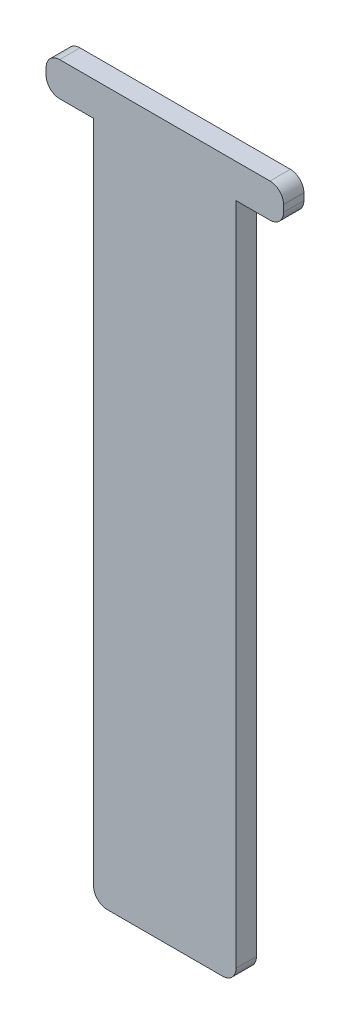
ISO-10303-21;
HEADER;
FILE_DESCRIPTION(('STEP AP214'),'2;1');
FILE_NAME('part.step','',(''),(''),'','','');
FILE_SCHEMA(('AUTOMOTIVE_DESIGN { 1 0 10303 214 1 1 1 1 }'));
ENDSEC;
DATA;
#1=APPLICATION_CONTEXT('core data for automotive mechanical design processes');
#2=APPLICATION_PROTOCOL_DEFINITION('international standard','automotive_design',2000,#1);
#3=PRODUCT_CONTEXT('',#1,'mechanical');
#4=PRODUCT('Part','Part','',(#3));
#5=PRODUCT_RELATED_PRODUCT_CATEGORY('part','',(#4));
#6=PRODUCT_DEFINITION_FORMATION('','',#4);
#7=PRODUCT_DEFINITION_CONTEXT('part definition',#1,'design');
#8=PRODUCT_DEFINITION('design','',#6,#7);
#9=PRODUCT_DEFINITION_SHAPE('','',#8);
#10=(LENGTH_UNIT() NAMED_UNIT(*) SI_UNIT(.MILLI.,.METRE.));
#11=(NAMED_UNIT(*) PLANE_ANGLE_UNIT() SI_UNIT($,.RADIAN.));
#12=(NAMED_UNIT(*) SI_UNIT($,.STERADIAN.) SOLID_ANGLE_UNIT());
#13=UNCERTAINTY_MEASURE_WITH_UNIT(LENGTH_MEASURE(1.E-05),#10,'distance_accuracy_value','');
#14=(GEOMETRIC_REPRESENTATION_CONTEXT(3) GLOBAL_UNCERTAINTY_ASSIGNED_CONTEXT((#13)) GLOBAL_UNIT_ASSIGNED_CONTEXT((#10,
#11,#12)) REPRESENTATION_CONTEXT('',''));
#15=CARTESIAN_POINT('',(0.,0.,0.));
#16=DIRECTION('',(0.,0.,1.));
#17=DIRECTION('',(1.,0.,0.));
#18=AXIS2_PLACEMENT_3D('',#15,#16,#17);
#19=CARTESIAN_POINT('',(-11.7609707284145,86.0573770491803,3.));
#20=DIRECTION('',(0.,1.,0.));
#21=DIRECTION('',(0.,0.,1.));
#22=AXIS2_PLACEMENT_3D('',#19,#20,#21);
#23=PLANE('',#22);
#24=DIRECTION('',(1.,0.,0.));
#25=VECTOR('',#24,1.);
#26=CARTESIAN_POINT('',(-11.7609707284145,86.0573770491803,0.));
#27=LINE('',#26,#25);
#28=CARTESIAN_POINT('',(-16.7609707284145,86.0573770491803,0.));
#29=VERTEX_POINT('',#28);
#30=CARTESIAN_POINT('',(-11.7609707284145,86.0573770491803,0.));
#31=VERTEX_POINT('',#30);
#32=EDGE_CURVE('E165',#29,#31,#27,.T.);
#33=ORIENTED_EDGE('',*,*,#32,.T.);
#34=DIRECTION('',(0.,0.,-1.));
#35=VECTOR('',#34,1.);
#36=CARTESIAN_POINT('',(-11.7609707284145,86.0573770491803,3.));
#37=LINE('',#36,#35);
#38=CARTESIAN_POINT('',(-11.7609707284145,86.0573770491803,3.));
#39=VERTEX_POINT('',#38);
#40=EDGE_CURVE('E11',#39,#31,#37,.T.);
#41=ORIENTED_EDGE('',*,*,#40,.F.);
#42=DIRECTION('',(1.,0.,0.));
#43=VECTOR('',#42,1.);
#44=CARTESIAN_POINT('',(-11.7609707284145,86.0573770491803,3.));
#45=LINE('',#44,#43);
#46=CARTESIAN_POINT('',(-16.7609707284145,86.0573770491803,3.));
#47=VERTEX_POINT('',#46);
#48=EDGE_CURVE('E191',#47,#39,#45,.T.);
#49=ORIENTED_EDGE('',*,*,#48,.F.);
#50=DIRECTION('',(0.,0.,-1.));
#51=VECTOR('',#50,1.);
#52=CARTESIAN_POINT('',(-16.7609707284145,86.0573770491803,3.));
#53=LINE('',#52,#51);
#54=EDGE_CURVE('E161',#47,#29,#53,.T.);
#55=ORIENTED_EDGE('',*,*,#54,.T.);
#56=EDGE_LOOP('',(#33,#41,#49,#55));
#57=FACE_BOUND('',#56,.T.);
#58=ADVANCED_FACE('F33',(#57),#23,.F.);
#59=CARTESIAN_POINT('',(-11.7609707284145,-11.9426229508197,3.));
#60=DIRECTION('',(1.,0.,0.));
#61=DIRECTION('',(0.,0.,-1.));
#62=AXIS2_PLACEMENT_3D('',#59,#60,#61);
#63=PLANE('',#62);
#64=DIRECTION('',(0.,-1.,0.));
#65=VECTOR('',#64,1.);
#66=CARTESIAN_POINT('',(-11.7609707284145,-11.9426229508197,0.));
#67=LINE('',#66,#65);
#68=CARTESIAN_POINT('',(-11.7609707284145,-11.9426229508197,0.));
#69=VERTEX_POINT('',#68);
#70=EDGE_CURVE('E168',#31,#69,#67,.T.);
#71=ORIENTED_EDGE('',*,*,#70,.T.);
#72=DIRECTION('',(0.,0.,-1.));
#73=VECTOR('',#72,1.);
#74=CARTESIAN_POINT('',(-11.7609707284145,-11.9426229508197,3.));
#75=LINE('',#74,#73);
#76=CARTESIAN_POINT('',(-11.7609707284145,-11.9426229508197,3.));
#77=VERTEX_POINT('',#76);
#78=EDGE_CURVE('E41',#77,#69,#75,.T.);
#79=ORIENTED_EDGE('',*,*,#78,.F.);
#80=DIRECTION('',(0.,-1.,0.));
#81=VECTOR('',#80,1.);
#82=CARTESIAN_POINT('',(-11.7609707284145,-11.9426229508197,3.));
#83=LINE('',#82,#81);
#84=EDGE_CURVE('E110',#39,#77,#83,.T.);
#85=ORIENTED_EDGE('',*,*,#84,.F.);
#86=ORIENTED_EDGE('',*,*,#40,.T.);
#87=EDGE_LOOP('',(#71,#79,#85,#86));
#88=FACE_BOUND('',#87,.T.);
#89=ADVANCED_FACE('F279',(#88),#63,.F.);
#90=CARTESIAN_POINT('',(-9.76097072841453,-11.9426229508197,3.));
#91=DIRECTION('',(0.,0.,-1.));
#92=DIRECTION('',(-1.,0.,0.));
#93=AXIS2_PLACEMENT_3D('',#90,#91,#92);
#94=CYLINDRICAL_SURFACE('',#93,2.);
#95=CARTESIAN_POINT('',(-9.76097072841453,-11.9426229508197,0.));
#96=DIRECTION('',(0.,0.,1.));
#97=DIRECTION('',(-1.,0.,0.));
#98=AXIS2_PLACEMENT_3D('',#95,#96,#97);
#99=CIRCLE('',#98,2.);
#100=CARTESIAN_POINT('',(-9.76097072841453,-13.9426229508197,0.));
#101=VERTEX_POINT('',#100);
#102=EDGE_CURVE('E170',#69,#101,#99,.T.);
#103=ORIENTED_EDGE('',*,*,#102,.T.);
#104=DIRECTION('',(0.,0.,-1.));
#105=VECTOR('',#104,1.);
#106=CARTESIAN_POINT('',(-9.76097072841453,-13.9426229508197,3.));
#107=LINE('',#106,#105);
#108=CARTESIAN_POINT('',(-9.76097072841453,-13.9426229508197,3.));
#109=VERTEX_POINT('',#108);
#110=EDGE_CURVE('E216',#109,#101,#107,.T.);
#111=ORIENTED_EDGE('',*,*,#110,.F.);
#112=CARTESIAN_POINT('',(-9.76097072841453,-11.9426229508197,3.));
#113=DIRECTION('',(0.,0.,1.));
#114=DIRECTION('',(-1.,0.,0.));
#115=AXIS2_PLACEMENT_3D('',#112,#113,#114);
#116=CIRCLE('',#115,2.);
#117=EDGE_CURVE('E224',#77,#109,#116,.T.);
#118=ORIENTED_EDGE('',*,*,#117,.F.);
#119=ORIENTED_EDGE('',*,*,#78,.T.);
#120=EDGE_LOOP('',(#103,#111,#118,#119));
#121=FACE_BOUND('',#120,.T.);
#122=ADVANCED_FACE('F222',(#121),#94,.T.);
#123=CARTESIAN_POINT('',(7.23902927158547,-13.9426229508197,3.));
#124=DIRECTION('',(0.,1.,0.));
#125=DIRECTION('',(0.,0.,1.));
#126=AXIS2_PLACEMENT_3D('',#123,#124,#125);
#127=PLANE('',#126);
#128=DIRECTION('',(1.,0.,0.));
#129=VECTOR('',#128,1.);
#130=CARTESIAN_POINT('',(7.23902927158547,-13.9426229508197,0.));
#131=LINE('',#130,#129);
#132=CARTESIAN_POINT('',(7.23902927158547,-13.9426229508197,0.));
#133=VERTEX_POINT('',#132);
#134=EDGE_CURVE('E172',#101,#133,#131,.T.);
#135=ORIENTED_EDGE('',*,*,#134,.T.);
#136=DIRECTION('',(0.,0.,-1.));
#137=VECTOR('',#136,1.);
#138=CARTESIAN_POINT('',(7.23902927158547,-13.9426229508197,3.));
#139=LINE('',#138,#137);
#140=CARTESIAN_POINT('',(7.23902927158547,-13.9426229508197,3.));
#141=VERTEX_POINT('',#140);
#142=EDGE_CURVE('E213',#141,#133,#139,.T.);
#143=ORIENTED_EDGE('',*,*,#142,.F.);
#144=DIRECTION('',(1.,0.,0.));
#145=VECTOR('',#144,1.);
#146=CARTESIAN_POINT('',(7.23902927158547,-13.9426229508197,3.));
#147=LINE('',#146,#145);
#148=EDGE_CURVE('E242',#109,#141,#147,.T.);
#149=ORIENTED_EDGE('',*,*,#148,.F.);
#150=ORIENTED_EDGE('',*,*,#110,.T.);
#151=EDGE_LOOP('',(#135,#143,#149,#150));
#152=FACE_BOUND('',#151,.T.);
#153=ADVANCED_FACE('F233',(#152),#127,.F.);
#154=CARTESIAN_POINT('',(7.23902927158547,-11.9426229508197,3.));
#155=DIRECTION('',(0.,0.,-1.));
#156=DIRECTION('',(-1.,0.,0.));
#157=AXIS2_PLACEMENT_3D('',#154,#155,#156);
#158=CYLINDRICAL_SURFACE('',#157,2.);
#159=CARTESIAN_POINT('',(7.23902927158547,-11.9426229508197,0.));
#160=DIRECTION('',(0.,0.,1.));
#161=DIRECTION('',(1.,0.,0.));
#162=AXIS2_PLACEMENT_3D('',#159,#160,#161);
#163=CIRCLE('',#162,2.);
#164=CARTESIAN_POINT('',(9.23902927158547,-11.9426229508197,0.));
#165=VERTEX_POINT('',#164);
#166=EDGE_CURVE('E174',#133,#165,#163,.T.);
#167=ORIENTED_EDGE('',*,*,#166,.T.);
#168=DIRECTION('',(0.,0.,-1.));
#169=VECTOR('',#168,1.);
#170=CARTESIAN_POINT('',(9.23902927158547,-11.9426229508197,3.));
#171=LINE('',#170,#169);
#172=CARTESIAN_POINT('',(9.23902927158547,-11.9426229508197,3.));
#173=VERTEX_POINT('',#172);
#174=EDGE_CURVE('E210',#173,#165,#171,.T.);
#175=ORIENTED_EDGE('',*,*,#174,.F.);
#176=CARTESIAN_POINT('',(7.23902927158547,-11.9426229508197,3.));
#177=DIRECTION('',(0.,0.,1.));
#178=DIRECTION('',(1.,0.,0.));
#179=AXIS2_PLACEMENT_3D('',#176,#177,#178);
#180=CIRCLE('',#179,2.);
#181=EDGE_CURVE('E239',#141,#173,#180,.T.);
#182=ORIENTED_EDGE('',*,*,#181,.F.);
#183=ORIENTED_EDGE('',*,*,#142,.T.);
#184=EDGE_LOOP('',(#167,#175,#182,#183));
#185=FACE_BOUND('',#184,.T.);
#186=ADVANCED_FACE('F237',(#185),#158,.T.);
#187=CARTESIAN_POINT('',(9.23902927158547,86.0573770491803,3.));
#188=DIRECTION('',(-1.,0.,0.));
#189=DIRECTION('',(0.,-1.,0.));
#190=AXIS2_PLACEMENT_3D('',#187,#188,#189);
#191=PLANE('',#190);
#192=DIRECTION('',(0.,1.,0.));
#193=VECTOR('',#192,1.);
#194=CARTESIAN_POINT('',(9.23902927158547,86.0573770491803,0.));
#195=LINE('',#194,#193);
#196=CARTESIAN_POINT('',(9.23902927158547,86.0573770491803,0.));
#197=VERTEX_POINT('',#196);
#198=EDGE_CURVE('E176',#165,#197,#195,.T.);
#199=ORIENTED_EDGE('',*,*,#198,.T.);
#200=DIRECTION('',(0.,0.,-1.));
#201=VECTOR('',#200,1.);
#202=CARTESIAN_POINT('',(9.23902927158547,86.0573770491803,3.));
#203=LINE('',#202,#201);
#204=CARTESIAN_POINT('',(9.23902927158547,86.0573770491803,3.));
#205=VERTEX_POINT('',#204);
#206=EDGE_CURVE('E207',#205,#197,#203,.T.);
#207=ORIENTED_EDGE('',*,*,#206,.F.);
#208=DIRECTION('',(0.,1.,0.));
#209=VECTOR('',#208,1.);
#210=CARTESIAN_POINT('',(9.23902927158547,86.0573770491803,3.));
#211=LINE('',#210,#209);
#212=EDGE_CURVE('E241',#173,#205,#211,.T.);
#213=ORIENTED_EDGE('',*,*,#212,.F.);
#214=ORIENTED_EDGE('',*,*,#174,.T.);
#215=EDGE_LOOP('',(#199,#207,#213,#214));
#216=FACE_BOUND('',#215,.T.);
#217=ADVANCED_FACE('F292',(#216),#191,.F.);
#218=CARTESIAN_POINT('',(14.2390292715855,86.0573770491803,3.));
#219=DIRECTION('',(0.,1.,0.));
#220=DIRECTION('',(0.,0.,1.));
#221=AXIS2_PLACEMENT_3D('',#218,#219,#220);
#222=PLANE('',#221);
#223=DIRECTION('',(1.,0.,0.));
#224=VECTOR('',#223,1.);
#225=CARTESIAN_POINT('',(14.2390292715855,86.0573770491803,0.));
#226=LINE('',#225,#224);
#227=CARTESIAN_POINT('',(14.2390292715855,86.0573770491803,0.));
#228=VERTEX_POINT('',#227);
#229=EDGE_CURVE('E178',#197,#228,#226,.T.);
#230=ORIENTED_EDGE('',*,*,#229,.T.);
#231=DIRECTION('',(0.,0.,-1.));
#232=VECTOR('',#231,1.);
#233=CARTESIAN_POINT('',(14.2390292715855,86.0573770491803,3.));
#234=LINE('',#233,#232);
#235=CARTESIAN_POINT('',(14.2390292715855,86.0573770491803,3.));
#236=VERTEX_POINT('',#235);
#237=EDGE_CURVE('E204',#236,#228,#234,.T.);
#238=ORIENTED_EDGE('',*,*,#237,.F.);
#239=DIRECTION('',(1.,0.,0.));
#240=VECTOR('',#239,1.);
#241=CARTESIAN_POINT('',(14.2390292715855,86.0573770491803,3.));
#242=LINE('',#241,#240);
#243=EDGE_CURVE('E244',#205,#236,#242,.T.);
#244=ORIENTED_EDGE('',*,*,#243,.F.);
#245=ORIENTED_EDGE('',*,*,#206,.T.);
#246=EDGE_LOOP('',(#230,#238,#244,#245));
#247=FACE_BOUND('',#246,.T.);
#248=ADVANCED_FACE('F295',(#247),#222,.F.);
#249=CARTESIAN_POINT('',(14.2390292715855,88.0573770491803,3.));
#250=DIRECTION('',(0.,0.,-1.));
#251=DIRECTION('',(-1.,0.,0.));
#252=AXIS2_PLACEMENT_3D('',#249,#250,#251);
#253=CYLINDRICAL_SURFACE('',#252,2.);
#254=CARTESIAN_POINT('',(14.2390292715855,88.0573770491803,0.));
#255=DIRECTION('',(0.,0.,1.));
#256=DIRECTION('',(1.,0.,0.));
#257=AXIS2_PLACEMENT_3D('',#254,#255,#256);
#258=CIRCLE('',#257,2.);
#259=CARTESIAN_POINT('',(16.2390292715855,88.0573770491803,0.));
#260=VERTEX_POINT('',#259);
#261=EDGE_CURVE('E180',#228,#260,#258,.T.);
#262=ORIENTED_EDGE('',*,*,#261,.T.);
#263=DIRECTION('',(0.,0.,-1.));
#264=VECTOR('',#263,1.);
#265=CARTESIAN_POINT('',(16.2390292715855,88.0573770491803,3.));
#266=LINE('',#265,#264);
#267=CARTESIAN_POINT('',(16.2390292715855,88.0573770491803,3.));
#268=VERTEX_POINT('',#267);
#269=EDGE_CURVE('E201',#268,#260,#266,.T.);
#270=ORIENTED_EDGE('',*,*,#269,.F.);
#271=CARTESIAN_POINT('',(14.2390292715855,88.0573770491803,3.));
#272=DIRECTION('',(0.,0.,1.));
#273=DIRECTION('',(1.,0.,0.));
#274=AXIS2_PLACEMENT_3D('',#271,#272,#273);
#275=CIRCLE('',#274,2.);
#276=EDGE_CURVE('E250',#236,#268,#275,.T.);
#277=ORIENTED_EDGE('',*,*,#276,.F.);
#278=ORIENTED_EDGE('',*,*,#237,.T.);
#279=EDGE_LOOP('',(#262,#270,#277,#278));
#280=FACE_BOUND('',#279,.T.);
#281=ADVANCED_FACE('F299',(#280),#253,.T.);
#282=CARTESIAN_POINT('',(16.2390292715855,89.0573770491803,3.));
#283=DIRECTION('',(-1.,0.,0.));
#284=DIRECTION('',(0.,-1.,0.));
#285=AXIS2_PLACEMENT_3D('',#282,#283,#284);
#286=PLANE('',#285);
#287=DIRECTION('',(0.,1.,0.));
#288=VECTOR('',#287,1.);
#289=CARTESIAN_POINT('',(16.2390292715855,89.0573770491803,0.));
#290=LINE('',#289,#288);
#291=CARTESIAN_POINT('',(16.2390292715855,89.0573770491803,0.));
#292=VERTEX_POINT('',#291);
#293=EDGE_CURVE('E182',#260,#292,#290,.T.);
#294=ORIENTED_EDGE('',*,*,#293,.T.);
#295=DIRECTION('',(0.,0.,-1.));
#296=VECTOR('',#295,1.);
#297=CARTESIAN_POINT('',(16.2390292715855,89.0573770491803,3.));
#298=LINE('',#297,#296);
#299=CARTESIAN_POINT('',(16.2390292715855,89.0573770491803,3.));
#300=VERTEX_POINT('',#299);
#301=EDGE_CURVE('E198',#300,#292,#298,.T.);
#302=ORIENTED_EDGE('',*,*,#301,.F.);
#303=DIRECTION('',(0.,1.,0.));
#304=VECTOR('',#303,1.);
#305=CARTESIAN_POINT('',(16.2390292715855,89.0573770491803,3.));
#306=LINE('',#305,#304);
#307=EDGE_CURVE('E252',#268,#300,#306,.T.);
#308=ORIENTED_EDGE('',*,*,#307,.F.);
#309=ORIENTED_EDGE('',*,*,#269,.T.);
#310=EDGE_LOOP('',(#294,#302,#308,#309));
#311=FACE_BOUND('',#310,.T.);
#312=ADVANCED_FACE('F303',(#311),#286,.F.);
#313=CARTESIAN_POINT('',(14.2390292715855,89.0573770491803,3.));
#314=DIRECTION('',(0.,0.,-1.));
#315=DIRECTION('',(-1.,0.,0.));
#316=AXIS2_PLACEMENT_3D('',#313,#314,#315);
#317=CYLINDRICAL_SURFACE('',#316,2.);
#318=CARTESIAN_POINT('',(14.2390292715855,89.0573770491803,0.));
#319=DIRECTION('',(0.,0.,1.));
#320=DIRECTION('',(1.,0.,0.));
#321=AXIS2_PLACEMENT_3D('',#318,#319,#320);
#322=CIRCLE('',#321,2.);
#323=CARTESIAN_POINT('',(14.2390292715855,91.0573770491803,0.));
#324=VERTEX_POINT('',#323);
#325=EDGE_CURVE('E184',#292,#324,#322,.T.);
#326=ORIENTED_EDGE('',*,*,#325,.T.);
#327=DIRECTION('',(0.,0.,-1.));
#328=VECTOR('',#327,1.);
#329=CARTESIAN_POINT('',(14.2390292715855,91.0573770491803,3.));
#330=LINE('',#329,#328);
#331=CARTESIAN_POINT('',(14.2390292715855,91.0573770491803,3.));
#332=VERTEX_POINT('',#331);
#333=EDGE_CURVE('E195',#332,#324,#330,.T.);
#334=ORIENTED_EDGE('',*,*,#333,.F.);
#335=CARTESIAN_POINT('',(14.2390292715855,89.0573770491803,3.));
#336=DIRECTION('',(0.,0.,1.));
#337=DIRECTION('',(1.,0.,0.));
#338=AXIS2_PLACEMENT_3D('',#335,#336,#337);
#339=CIRCLE('',#338,2.);
#340=EDGE_CURVE('E254',#300,#332,#339,.T.);
#341=ORIENTED_EDGE('',*,*,#340,.F.);
#342=ORIENTED_EDGE('',*,*,#301,.T.);
#343=EDGE_LOOP('',(#326,#334,#341,#342));
#344=FACE_BOUND('',#343,.T.);
#345=ADVANCED_FACE('F260',(#344),#317,.T.);
#346=CARTESIAN_POINT('',(-16.7609707284145,91.0573770491803,3.));
#347=DIRECTION('',(0.,-1.,0.));
#348=DIRECTION('',(0.,0.,-1.));
#349=AXIS2_PLACEMENT_3D('',#346,#347,#348);
#350=PLANE('',#349);
#351=DIRECTION('',(-1.,0.,0.));
#352=VECTOR('',#351,1.);
#353=CARTESIAN_POINT('',(-16.7609707284145,91.0573770491803,0.));
#354=LINE('',#353,#352);
#355=CARTESIAN_POINT('',(-16.7609707284145,91.0573770491803,0.));
#356=VERTEX_POINT('',#355);
#357=EDGE_CURVE('E186',#324,#356,#354,.T.);
#358=ORIENTED_EDGE('',*,*,#357,.T.);
#359=DIRECTION('',(0.,0.,-1.));
#360=VECTOR('',#359,1.);
#361=CARTESIAN_POINT('',(-16.7609707284145,91.0573770491803,3.));
#362=LINE('',#361,#360);
#363=CARTESIAN_POINT('',(-16.7609707284145,91.0573770491803,3.));
#364=VERTEX_POINT('',#363);
#365=EDGE_CURVE('E156',#364,#356,#362,.T.);
#366=ORIENTED_EDGE('',*,*,#365,.F.);
#367=DIRECTION('',(-1.,0.,0.));
#368=VECTOR('',#367,1.);
#369=CARTESIAN_POINT('',(-16.7609707284145,91.0573770491803,3.));
#370=LINE('',#369,#368);
#371=EDGE_CURVE('E147',#332,#364,#370,.T.);
#372=ORIENTED_EDGE('',*,*,#371,.F.);
#373=ORIENTED_EDGE('',*,*,#333,.T.);
#374=EDGE_LOOP('',(#358,#366,#372,#373));
#375=FACE_BOUND('',#374,.T.);
#376=ADVANCED_FACE('F264',(#375),#350,.F.);
#377=CARTESIAN_POINT('',(-16.7609707284145,89.0573770491803,3.));
#378=DIRECTION('',(0.,0.,-1.));
#379=DIRECTION('',(-1.,0.,0.));
#380=AXIS2_PLACEMENT_3D('',#377,#378,#379);
#381=CYLINDRICAL_SURFACE('',#380,2.);
#382=CARTESIAN_POINT('',(-16.7609707284145,89.0573770491803,0.));
#383=DIRECTION('',(0.,0.,1.));
#384=DIRECTION('',(1.,0.,0.));
#385=AXIS2_PLACEMENT_3D('',#382,#383,#384);
#386=CIRCLE('',#385,2.);
#387=CARTESIAN_POINT('',(-18.7609707284145,89.0573770491803,0.));
#388=VERTEX_POINT('',#387);
#389=EDGE_CURVE('E155',#356,#388,#386,.T.);
#390=ORIENTED_EDGE('',*,*,#389,.T.);
#391=DIRECTION('',(0.,0.,-1.));
#392=VECTOR('',#391,1.);
#393=CARTESIAN_POINT('',(-18.7609707284145,89.0573770491803,3.));
#394=LINE('',#393,#392);
#395=CARTESIAN_POINT('',(-18.7609707284145,89.0573770491803,3.));
#396=VERTEX_POINT('',#395);
#397=EDGE_CURVE('E152',#396,#388,#394,.T.);
#398=ORIENTED_EDGE('',*,*,#397,.F.);
#399=CARTESIAN_POINT('',(-16.7609707284145,89.0573770491803,3.));
#400=DIRECTION('',(0.,0.,1.));
#401=DIRECTION('',(1.,0.,0.));
#402=AXIS2_PLACEMENT_3D('',#399,#400,#401);
#403=CIRCLE('',#402,2.);
#404=EDGE_CURVE('E141',#364,#396,#403,.T.);
#405=ORIENTED_EDGE('',*,*,#404,.F.);
#406=ORIENTED_EDGE('',*,*,#365,.T.);
#407=EDGE_LOOP('',(#390,#398,#405,#406));
#408=FACE_BOUND('',#407,.T.);
#409=ADVANCED_FACE('F153',(#408),#381,.T.);
#410=CARTESIAN_POINT('',(-18.7609707284145,88.0573770491803,3.));
#411=DIRECTION('',(1.,0.,0.));
#412=DIRECTION('',(0.,1.,0.));
#413=AXIS2_PLACEMENT_3D('',#410,#411,#412);
#414=PLANE('',#413);
#415=DIRECTION('',(0.,-1.,0.));
#416=VECTOR('',#415,1.);
#417=CARTESIAN_POINT('',(-18.7609707284145,88.0573770491803,0.));
#418=LINE('',#417,#416);
#419=CARTESIAN_POINT('',(-18.7609707284145,88.0573770491803,0.));
#420=VERTEX_POINT('',#419);
#421=EDGE_CURVE('E96',#388,#420,#418,.T.);
#422=ORIENTED_EDGE('',*,*,#421,.T.);
#423=DIRECTION('',(0.,0.,-1.));
#424=VECTOR('',#423,1.);
#425=CARTESIAN_POINT('',(-18.7609707284145,88.0573770491803,3.));
#426=LINE('',#425,#424);
#427=CARTESIAN_POINT('',(-18.7609707284145,88.0573770491803,3.));
#428=VERTEX_POINT('',#427);
#429=EDGE_CURVE('E157',#428,#420,#426,.T.);
#430=ORIENTED_EDGE('',*,*,#429,.F.);
#431=DIRECTION('',(0.,-1.,0.));
#432=VECTOR('',#431,1.);
#433=CARTESIAN_POINT('',(-18.7609707284145,88.0573770491803,3.));
#434=LINE('',#433,#432);
#435=EDGE_CURVE('E145',#396,#428,#434,.T.);
#436=ORIENTED_EDGE('',*,*,#435,.F.);
#437=ORIENTED_EDGE('',*,*,#397,.T.);
#438=EDGE_LOOP('',(#422,#430,#436,#437));
#439=FACE_BOUND('',#438,.T.);
#440=ADVANCED_FACE('F159',(#439),#414,.F.);
#441=CARTESIAN_POINT('',(-16.7609707284145,88.0573770491803,3.));
#442=DIRECTION('',(0.,0.,-1.));
#443=DIRECTION('',(-1.,0.,0.));
#444=AXIS2_PLACEMENT_3D('',#441,#442,#443);
#445=CYLINDRICAL_SURFACE('',#444,2.);
#446=CARTESIAN_POINT('',(-16.7609707284145,88.0573770491803,0.));
#447=DIRECTION('',(0.,0.,1.));
#448=DIRECTION('',(-1.,0.,0.));
#449=AXIS2_PLACEMENT_3D('',#446,#447,#448);
#450=CIRCLE('',#449,2.);
#451=EDGE_CURVE('E102',#420,#29,#450,.T.);
#452=ORIENTED_EDGE('',*,*,#451,.T.);
#453=ORIENTED_EDGE('',*,*,#54,.F.);
#454=CARTESIAN_POINT('',(-16.7609707284145,88.0573770491803,3.));
#455=DIRECTION('',(0.,0.,1.));
#456=DIRECTION('',(-1.,0.,0.));
#457=AXIS2_PLACEMENT_3D('',#454,#455,#456);
#458=CIRCLE('',#457,2.);
#459=EDGE_CURVE('E49',#428,#47,#458,.T.);
#460=ORIENTED_EDGE('',*,*,#459,.F.);
#461=ORIENTED_EDGE('',*,*,#429,.T.);
#462=EDGE_LOOP('',(#452,#453,#460,#461));
#463=FACE_BOUND('',#462,.T.);
#464=ADVANCED_FACE('F268',(#463),#445,.T.);
#465=CARTESIAN_POINT('',(-16.7609707284145,88.0573770491803,3.));
#466=DIRECTION('',(0.,0.,-1.));
#467=DIRECTION('',(-1.,0.,0.));
#468=AXIS2_PLACEMENT_3D('',#465,#466,#467);
#469=PLANE('',#468);
#470=ORIENTED_EDGE('',*,*,#48,.T.);
#471=ORIENTED_EDGE('',*,*,#84,.T.);
#472=ORIENTED_EDGE('',*,*,#117,.T.);
#473=ORIENTED_EDGE('',*,*,#148,.T.);
#474=ORIENTED_EDGE('',*,*,#181,.T.);
#475=ORIENTED_EDGE('',*,*,#212,.T.);
#476=ORIENTED_EDGE('',*,*,#243,.T.);
#477=ORIENTED_EDGE('',*,*,#276,.T.);
#478=ORIENTED_EDGE('',*,*,#307,.T.);
#479=ORIENTED_EDGE('',*,*,#340,.T.);
#480=ORIENTED_EDGE('',*,*,#371,.T.);
#481=ORIENTED_EDGE('',*,*,#404,.T.);
#482=ORIENTED_EDGE('',*,*,#435,.T.);
#483=ORIENTED_EDGE('',*,*,#459,.T.);
#484=EDGE_LOOP('',(#470,#471,#472,#473,#474,#475,#476,#477,#478,#479,#480,#481,#482,#483));
#485=FACE_BOUND('',#484,.T.);
#486=ADVANCED_FACE('F143',(#485),#469,.F.);
#487=CARTESIAN_POINT('',(-16.7609707284145,88.0573770491803,0.));
#488=DIRECTION('',(0.,0.,-1.));
#489=DIRECTION('',(-1.,0.,0.));
#490=AXIS2_PLACEMENT_3D('',#487,#488,#489);
#491=PLANE('',#490);
#492=ORIENTED_EDGE('',*,*,#32,.F.);
#493=ORIENTED_EDGE('',*,*,#451,.F.);
#494=ORIENTED_EDGE('',*,*,#421,.F.);
#495=ORIENTED_EDGE('',*,*,#389,.F.);
#496=ORIENTED_EDGE('',*,*,#357,.F.);
#497=ORIENTED_EDGE('',*,*,#325,.F.);
#498=ORIENTED_EDGE('',*,*,#293,.F.);
#499=ORIENTED_EDGE('',*,*,#261,.F.);
#500=ORIENTED_EDGE('',*,*,#229,.F.);
#501=ORIENTED_EDGE('',*,*,#198,.F.);
#502=ORIENTED_EDGE('',*,*,#166,.F.);
#503=ORIENTED_EDGE('',*,*,#134,.F.);
#504=ORIENTED_EDGE('',*,*,#102,.F.);
#505=ORIENTED_EDGE('',*,*,#70,.F.);
#506=EDGE_LOOP('',(#492,#493,#494,#495,#496,#497,#498,#499,#500,#501,#502,#503,#504,#505));
#507=FACE_BOUND('',#506,.T.);
#508=ADVANCED_FACE('F228',(#507),#491,.T.);
#509=CLOSED_SHELL('',(#58,#89,#122,#153,#186,#217,#248,#281,#312,#345,#376,#409,#440,#464,#486,#508));
#510=MANIFOLD_SOLID_BREP('B2',#509);
#511=ADVANCED_BREP_SHAPE_REPRESENTATION('',(#18,#510),#14);
#512=SHAPE_DEFINITION_REPRESENTATION(#9,#511);
ENDSEC;
END-ISO-10303-21;
